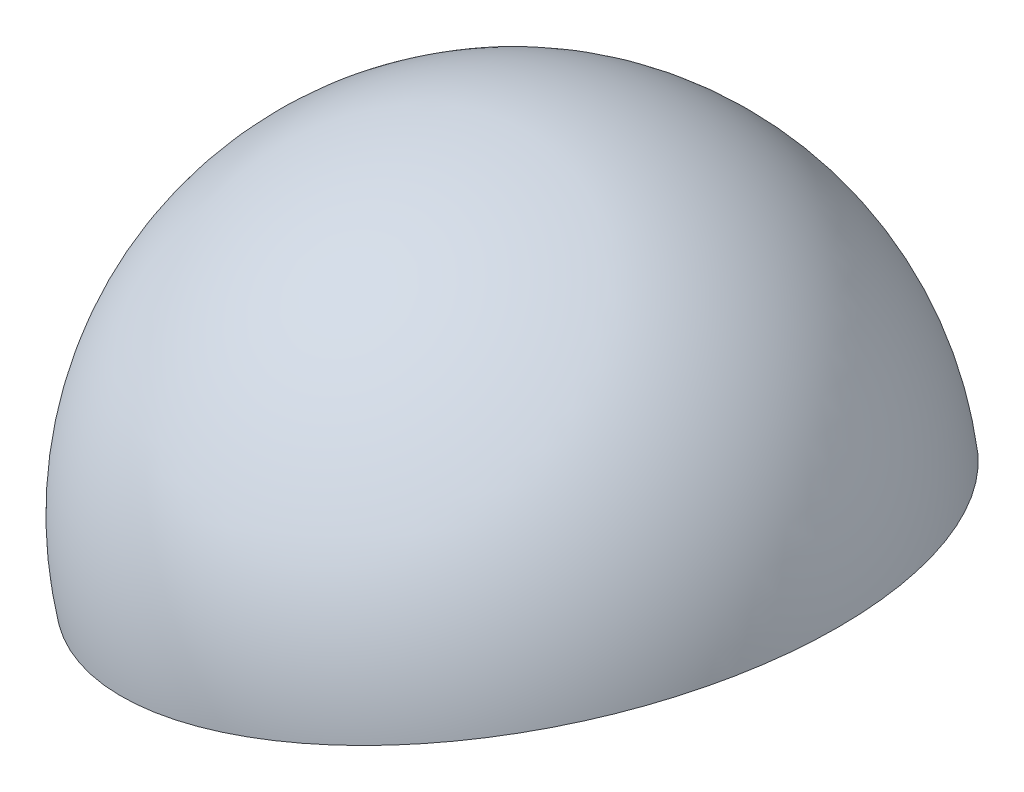
ISO-10303-21;
HEADER;
FILE_DESCRIPTION(('STEP AP214'),'2;1');
FILE_NAME('part.step','',(''),(''),'','','');
FILE_SCHEMA(('AUTOMOTIVE_DESIGN { 1 0 10303 214 1 1 1 1 }'));
ENDSEC;
DATA;
#1=APPLICATION_CONTEXT('core data for automotive mechanical design processes');
#2=APPLICATION_PROTOCOL_DEFINITION('international standard','automotive_design',2000,#1);
#3=PRODUCT_CONTEXT('',#1,'mechanical');
#4=PRODUCT('Part','Part','',(#3));
#5=PRODUCT_RELATED_PRODUCT_CATEGORY('part','',(#4));
#6=PRODUCT_DEFINITION_FORMATION('','',#4);
#7=PRODUCT_DEFINITION_CONTEXT('part definition',#1,'design');
#8=PRODUCT_DEFINITION('design','',#6,#7);
#9=PRODUCT_DEFINITION_SHAPE('','',#8);
#10=(LENGTH_UNIT() NAMED_UNIT(*) SI_UNIT(.MILLI.,.METRE.));
#11=(NAMED_UNIT(*) PLANE_ANGLE_UNIT() SI_UNIT($,.RADIAN.));
#12=(NAMED_UNIT(*) SI_UNIT($,.STERADIAN.) SOLID_ANGLE_UNIT());
#13=UNCERTAINTY_MEASURE_WITH_UNIT(LENGTH_MEASURE(1.E-05),#10,'distance_accuracy_value','');
#14=(GEOMETRIC_REPRESENTATION_CONTEXT(3) GLOBAL_UNCERTAINTY_ASSIGNED_CONTEXT((#13)) GLOBAL_UNIT_ASSIGNED_CONTEXT((#10,
#11,#12)) REPRESENTATION_CONTEXT('',''));
#15=CARTESIAN_POINT('',(0.,0.,0.));
#16=DIRECTION('',(0.,0.,1.));
#17=DIRECTION('',(1.,0.,0.));
#18=AXIS2_PLACEMENT_3D('',#15,#16,#17);
#19=CARTESIAN_POINT('',(0.477900885598974,-1.95142861619579,0.));
#20=DIRECTION('',(0.237868729379259,-0.971297311631973,0.));
#21=DIRECTION('',(0.971297311631973,0.237868729379259,0.));
#22=AXIS2_PLACEMENT_3D('',#19,#20,#21);
#23=SPHERICAL_SURFACE('',#22,12.4514831485492);
#24=CARTESIAN_POINT('',(0.605412951602206,-2.47210288570901,0.));
#25=DIRECTION('',(0.237868729379259,-0.971297311631973,0.));
#26=DIRECTION('',(0.971297311631973,0.237868729379259,0.));
#27=AXIS2_PLACEMENT_3D('',#24,#25,#26);
#28=CIRCLE('',#27,12.4399417470593);
#29=CARTESIAN_POINT('',(12.6882949273793,0.486970251215988,0.));
#30=VERTEX_POINT('',#29);
#31=EDGE_CURVE('E10',#30,#30,#28,.T.);
#32=ORIENTED_EDGE('',*,*,#31,.F.);
#33=EDGE_LOOP('',(#32));
#34=FACE_BOUND('',#33,.T.);
#35=ADVANCED_FACE('F33',(#34),#23,.T.);
#36=CARTESIAN_POINT('',(0.589797280078574,-2.40833889365419,0.));
#37=DIRECTION('',(0.237868729379259,-0.971297311631973,0.));
#38=DIRECTION('',(0.971297311631973,0.237868729379259,0.));
#39=AXIS2_PLACEMENT_3D('',#36,#37,#38);
#40=CONICAL_SURFACE('',#39,10.9413790009189,1.52701682717455);
#41=ORIENTED_EDGE('',*,*,#31,.T.);
#42=EDGE_LOOP('',(#41));
#43=FACE_BOUND('',#42,.T.);
#44=CARTESIAN_POINT('',(0.589797280078574,-2.40833889365419,0.));
#45=DIRECTION('',(0.237868729379259,-0.971297311631973,0.));
#46=DIRECTION('',(0.971297311631973,0.237868729379259,0.));
#47=AXIS2_PLACEMENT_3D('',#44,#45,#46);
#48=CIRCLE('',#47,10.9413790009189);
#49=CARTESIAN_POINT('',(11.2171292892176,0.194273026951282,0.));
#50=VERTEX_POINT('',#49);
#51=EDGE_CURVE('E39',#50,#50,#48,.T.);
#52=ORIENTED_EDGE('',*,*,#51,.F.);
#53=EDGE_LOOP('',(#52));
#54=FACE_BOUND('',#53,.T.);
#55=ADVANCED_FACE('F65',(#43,#54),#40,.F.);
#56=CARTESIAN_POINT('',(0.,1.11022302462516E-13,0.));
#57=DIRECTION('',(-0.237868729379259,0.971297311631973,0.));
#58=DIRECTION('',(-0.971297311631973,-0.237868729379259,0.));
#59=AXIS2_PLACEMENT_3D('',#56,#57,#58);
#60=CONICAL_SURFACE('',#59,11.05,0.0437794996203566);
#61=ORIENTED_EDGE('',*,*,#51,.T.);
#62=EDGE_LOOP('',(#61));
#63=FACE_BOUND('',#62,.T.);
#64=CARTESIAN_POINT('',(0.,1.11022302462516E-13,0.));
#65=DIRECTION('',(0.237868729379259,-0.971297311631973,0.));
#66=DIRECTION('',(0.971297311631973,0.237868729379259,0.));
#67=AXIS2_PLACEMENT_3D('',#64,#65,#66);
#68=CIRCLE('',#67,11.05);
#69=CARTESIAN_POINT('',(10.7328352935333,2.62844945964092,0.));
#70=VERTEX_POINT('',#69);
#71=EDGE_CURVE('E43',#70,#70,#68,.T.);
#72=ORIENTED_EDGE('',*,*,#71,.F.);
#73=EDGE_LOOP('',(#72));
#74=FACE_BOUND('',#73,.T.);
#75=ADVANCED_FACE('F57',(#63,#74),#60,.F.);
#76=CARTESIAN_POINT('',(0.,0.,0.));
#77=DIRECTION('',(0.237868729379259,-0.971297311631973,0.));
#78=DIRECTION('',(0.971297311631973,0.237868729379259,0.));
#79=AXIS2_PLACEMENT_3D('',#76,#77,#78);
#80=PLANE('',#79);
#81=ORIENTED_EDGE('',*,*,#71,.T.);
#82=EDGE_LOOP('',(#81));
#83=FACE_BOUND('',#82,.T.);
#84=CARTESIAN_POINT('',(0.,0.,0.));
#85=DIRECTION('',(0.237868729379259,-0.971297311631973,0.));
#86=DIRECTION('',(0.971297311631973,0.237868729379259,0.));
#87=AXIS2_PLACEMENT_3D('',#84,#85,#86);
#88=CIRCLE('',#87,9.55);
#89=CARTESIAN_POINT('',(9.27588932608533,2.27164636557198,0.));
#90=VERTEX_POINT('',#89);
#91=EDGE_CURVE('E47',#90,#90,#88,.T.);
#92=ORIENTED_EDGE('',*,*,#91,.F.);
#93=EDGE_LOOP('',(#92));
#94=FACE_BOUND('',#93,.T.);
#95=ADVANCED_FACE('F55',(#83,#94),#80,.T.);
#96=CARTESIAN_POINT('',(0.,0.,0.));
#97=DIRECTION('',(0.237868729379259,-0.971297311631973,0.));
#98=DIRECTION('',(0.971297311631973,0.237868729379259,0.));
#99=AXIS2_PLACEMENT_3D('',#96,#97,#98);
#100=SPHERICAL_SURFACE('',#99,9.55);
#101=ORIENTED_EDGE('',*,*,#91,.T.);
#102=EDGE_LOOP('',(#101));
#103=FACE_BOUND('',#102,.T.);
#104=ADVANCED_FACE('F53',(#103),#100,.F.);
#105=CLOSED_SHELL('',(#35,#55,#75,#95,#104));
#106=MANIFOLD_SOLID_BREP('B2',#105);
#107=ADVANCED_BREP_SHAPE_REPRESENTATION('',(#18,#106),#14);
#108=SHAPE_DEFINITION_REPRESENTATION(#9,#107);
ENDSEC;
END-ISO-10303-21;
